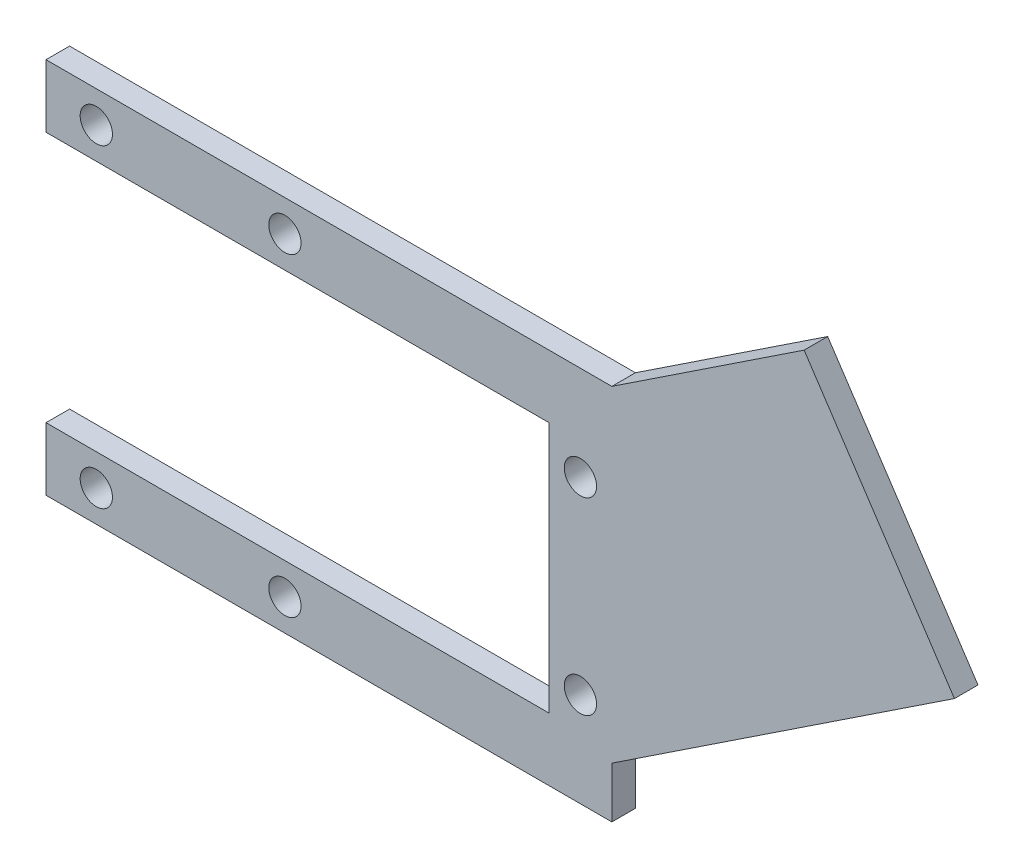
ISO-10303-21;
HEADER;
FILE_DESCRIPTION(('STEP AP214'),'2;1');
FILE_NAME('part.step','',(''),(''),'','','');
FILE_SCHEMA(('AUTOMOTIVE_DESIGN { 1 0 10303 214 1 1 1 1 }'));
ENDSEC;
DATA;
#1=APPLICATION_CONTEXT('core data for automotive mechanical design processes');
#2=APPLICATION_PROTOCOL_DEFINITION('international standard','automotive_design',2000,#1);
#3=PRODUCT_CONTEXT('',#1,'mechanical');
#4=PRODUCT('Part','Part','',(#3));
#5=PRODUCT_RELATED_PRODUCT_CATEGORY('part','',(#4));
#6=PRODUCT_DEFINITION_FORMATION('','',#4);
#7=PRODUCT_DEFINITION_CONTEXT('part definition',#1,'design');
#8=PRODUCT_DEFINITION('design','',#6,#7);
#9=PRODUCT_DEFINITION_SHAPE('','',#8);
#10=(LENGTH_UNIT() NAMED_UNIT(*) SI_UNIT(.MILLI.,.METRE.));
#11=(NAMED_UNIT(*) PLANE_ANGLE_UNIT() SI_UNIT($,.RADIAN.));
#12=(NAMED_UNIT(*) SI_UNIT($,.STERADIAN.) SOLID_ANGLE_UNIT());
#13=UNCERTAINTY_MEASURE_WITH_UNIT(LENGTH_MEASURE(1.E-05),#10,'distance_accuracy_value','');
#14=(GEOMETRIC_REPRESENTATION_CONTEXT(3) GLOBAL_UNCERTAINTY_ASSIGNED_CONTEXT((#13)) GLOBAL_UNIT_ASSIGNED_CONTEXT((#10,
#11,#12)) REPRESENTATION_CONTEXT('',''));
#15=CARTESIAN_POINT('',(0.,0.,0.));
#16=DIRECTION('',(0.,0.,1.));
#17=DIRECTION('',(1.,0.,0.));
#18=AXIS2_PLACEMENT_3D('',#15,#16,#17);
#19=CARTESIAN_POINT('',(0.,0.,4.7625));
#20=DIRECTION('',(0.,0.,1.));
#21=DIRECTION('',(1.,0.,0.));
#22=AXIS2_PLACEMENT_3D('',#19,#20,#21);
#23=PLANE('',#22);
#24=CARTESIAN_POINT('',(107.95,-6.34999999999999,4.7625));
#25=DIRECTION('',(0.,0.,1.));
#26=DIRECTION('',(1.,0.,0.));
#27=AXIS2_PLACEMENT_3D('',#24,#25,#26);
#28=CIRCLE('',#27,3.26389999999999);
#29=CARTESIAN_POINT('',(111.2139,-6.34999999999999,4.7625));
#30=VERTEX_POINT('',#29);
#31=EDGE_CURVE('E280',#30,#30,#28,.T.);
#32=ORIENTED_EDGE('',*,*,#31,.F.);
#33=EDGE_LOOP('',(#32));
#34=FACE_BOUND('',#33,.T.);
#35=CARTESIAN_POINT('',(107.95,-44.45,4.7625));
#36=DIRECTION('',(0.,0.,1.));
#37=DIRECTION('',(1.,0.,0.));
#38=AXIS2_PLACEMENT_3D('',#35,#36,#37);
#39=CIRCLE('',#38,3.2639);
#40=CARTESIAN_POINT('',(111.2139,-44.45,4.7625));
#41=VERTEX_POINT('',#40);
#42=EDGE_CURVE('E289',#41,#41,#39,.T.);
#43=ORIENTED_EDGE('',*,*,#42,.F.);
#44=EDGE_LOOP('',(#43));
#45=FACE_BOUND('',#44,.T.);
#46=CARTESIAN_POINT('',(10.16,-57.15,4.7625));
#47=DIRECTION('',(0.,0.,1.));
#48=DIRECTION('',(1.,0.,0.));
#49=AXIS2_PLACEMENT_3D('',#46,#47,#48);
#50=CIRCLE('',#49,3.26390000000001);
#51=CARTESIAN_POINT('',(13.4239,-57.15,4.7625));
#52=VERTEX_POINT('',#51);
#53=EDGE_CURVE('E300',#52,#52,#50,.T.);
#54=ORIENTED_EDGE('',*,*,#53,.F.);
#55=EDGE_LOOP('',(#54));
#56=FACE_BOUND('',#55,.T.);
#57=CARTESIAN_POINT('',(10.16,6.35,4.7625));
#58=DIRECTION('',(0.,0.,1.));
#59=DIRECTION('',(1.,0.,0.));
#60=AXIS2_PLACEMENT_3D('',#57,#58,#59);
#61=CIRCLE('',#60,3.26390000000001);
#62=CARTESIAN_POINT('',(13.4239,6.35,4.7625));
#63=VERTEX_POINT('',#62);
#64=EDGE_CURVE('E156',#63,#63,#61,.T.);
#65=ORIENTED_EDGE('',*,*,#64,.F.);
#66=EDGE_LOOP('',(#65));
#67=FACE_BOUND('',#66,.T.);
#68=DIRECTION('',(0.,-1.,0.));
#69=VECTOR('',#68,1.);
#70=CARTESIAN_POINT('',(0.,12.7,4.7625));
#71=LINE('',#70,#69);
#72=CARTESIAN_POINT('',(0.,12.7,4.7625));
#73=VERTEX_POINT('',#72);
#74=CARTESIAN_POINT('',(0.,0.,4.7625));
#75=VERTEX_POINT('',#74);
#76=EDGE_CURVE('E173',#73,#75,#71,.T.);
#77=ORIENTED_EDGE('',*,*,#76,.T.);
#78=DIRECTION('',(1.,0.,0.));
#79=VECTOR('',#78,1.);
#80=CARTESIAN_POINT('',(0.,0.,4.7625));
#81=LINE('',#80,#79);
#82=CARTESIAN_POINT('',(101.6,0.,4.7625));
#83=VERTEX_POINT('',#82);
#84=EDGE_CURVE('E106',#75,#83,#81,.T.);
#85=ORIENTED_EDGE('',*,*,#84,.T.);
#86=DIRECTION('',(0.,-1.,0.));
#87=VECTOR('',#86,1.);
#88=CARTESIAN_POINT('',(101.6,0.,4.7625));
#89=LINE('',#88,#87);
#90=CARTESIAN_POINT('',(101.6,-50.8,4.7625));
#91=VERTEX_POINT('',#90);
#92=EDGE_CURVE('E197',#83,#91,#89,.T.);
#93=ORIENTED_EDGE('',*,*,#92,.T.);
#94=DIRECTION('',(-1.,0.,0.));
#95=VECTOR('',#94,1.);
#96=CARTESIAN_POINT('',(101.6,-50.8,4.7625));
#97=LINE('',#96,#95);
#98=CARTESIAN_POINT('',(0.,-50.8,4.7625));
#99=VERTEX_POINT('',#98);
#100=EDGE_CURVE('E216',#91,#99,#97,.T.);
#101=ORIENTED_EDGE('',*,*,#100,.T.);
#102=DIRECTION('',(0.,-1.,0.));
#103=VECTOR('',#102,1.);
#104=CARTESIAN_POINT('',(0.,-50.8,4.7625));
#105=LINE('',#104,#103);
#106=CARTESIAN_POINT('',(0.,-63.5,4.7625));
#107=VERTEX_POINT('',#106);
#108=EDGE_CURVE('E213',#99,#107,#105,.T.);
#109=ORIENTED_EDGE('',*,*,#108,.T.);
#110=DIRECTION('',(1.,0.,0.));
#111=VECTOR('',#110,1.);
#112=CARTESIAN_POINT('',(0.,-63.5,4.7625));
#113=LINE('',#112,#111);
#114=CARTESIAN_POINT('',(114.3,-63.5,4.7625));
#115=VERTEX_POINT('',#114);
#116=EDGE_CURVE('E215',#107,#115,#113,.T.);
#117=ORIENTED_EDGE('',*,*,#116,.T.);
#118=DIRECTION('',(0.,1.,0.));
#119=VECTOR('',#118,1.);
#120=CARTESIAN_POINT('',(114.3,-53.215281421838,4.7625));
#121=LINE('',#120,#119);
#122=CARTESIAN_POINT('',(114.3,-53.215281421838,4.7625));
#123=VERTEX_POINT('',#122);
#124=EDGE_CURVE('E218',#115,#123,#121,.T.);
#125=ORIENTED_EDGE('',*,*,#124,.T.);
#126=DIRECTION('',(0.833382067243564,0.552697322226953,0.));
#127=VECTOR('',#126,1.);
#128=CARTESIAN_POINT('',(183.499345052176,-7.32241401625874,4.7625));
#129=LINE('',#128,#127);
#130=CARTESIAN_POINT('',(183.499345052176,-7.32241401625874,4.7625));
#131=VERTEX_POINT('',#130);
#132=EDGE_CURVE('E134',#123,#131,#129,.T.);
#133=ORIENTED_EDGE('',*,*,#132,.T.);
#134=DIRECTION('',(-0.552697322226953,0.833382067243564,0.));
#135=VECTOR('',#134,1.);
#136=CARTESIAN_POINT('',(153.138236670963,38.4574409766899,4.7625));
#137=LINE('',#136,#135);
#138=CARTESIAN_POINT('',(153.138236670963,38.4574409766899,4.7625));
#139=VERTEX_POINT('',#138);
#140=EDGE_CURVE('E128',#131,#139,#137,.T.);
#141=ORIENTED_EDGE('',*,*,#140,.T.);
#142=DIRECTION('',(-0.833382067243564,-0.552697322226953,0.));
#143=VECTOR('',#142,1.);
#144=CARTESIAN_POINT('',(114.3,12.7,4.7625));
#145=LINE('',#144,#143);
#146=CARTESIAN_POINT('',(114.3,12.7,4.7625));
#147=VERTEX_POINT('',#146);
#148=EDGE_CURVE('E132',#139,#147,#145,.T.);
#149=ORIENTED_EDGE('',*,*,#148,.T.);
#150=DIRECTION('',(-1.,0.,0.));
#151=VECTOR('',#150,1.);
#152=CARTESIAN_POINT('',(114.3,12.7,4.7625));
#153=LINE('',#152,#151);
#154=EDGE_CURVE('E54',#147,#73,#153,.T.);
#155=ORIENTED_EDGE('',*,*,#154,.T.);
#156=EDGE_LOOP('',(#77,#85,#93,#101,#109,#117,#125,#133,#141,#149,#155));
#157=FACE_BOUND('',#156,.T.);
#158=CARTESIAN_POINT('',(48.26,6.35,4.7625));
#159=DIRECTION('',(0.,0.,1.));
#160=DIRECTION('',(1.,0.,0.));
#161=AXIS2_PLACEMENT_3D('',#158,#159,#160);
#162=CIRCLE('',#161,3.26389999999999);
#163=CARTESIAN_POINT('',(51.5239,6.35,4.7625));
#164=VERTEX_POINT('',#163);
#165=EDGE_CURVE('E306',#164,#164,#162,.T.);
#166=ORIENTED_EDGE('',*,*,#165,.F.);
#167=EDGE_LOOP('',(#166));
#168=FACE_BOUND('',#167,.T.);
#169=CARTESIAN_POINT('',(48.26,-57.15,4.7625));
#170=DIRECTION('',(0.,0.,1.));
#171=DIRECTION('',(1.,0.,0.));
#172=AXIS2_PLACEMENT_3D('',#169,#170,#171);
#173=CIRCLE('',#172,3.26389999999999);
#174=CARTESIAN_POINT('',(51.5239,-57.15,4.7625));
#175=VERTEX_POINT('',#174);
#176=EDGE_CURVE('E287',#175,#175,#173,.T.);
#177=ORIENTED_EDGE('',*,*,#176,.F.);
#178=EDGE_LOOP('',(#177));
#179=FACE_BOUND('',#178,.T.);
#180=ADVANCED_FACE('F37',(#34,#45,#56,#67,#157,#168,#179),#23,.T.);
#181=CARTESIAN_POINT('',(0.,0.,0.));
#182=DIRECTION('',(0.,0.,1.));
#183=DIRECTION('',(1.,0.,0.));
#184=AXIS2_PLACEMENT_3D('',#181,#182,#183);
#185=PLANE('',#184);
#186=CARTESIAN_POINT('',(107.95,-6.34999999999999,0.));
#187=DIRECTION('',(0.,0.,1.));
#188=DIRECTION('',(1.,0.,0.));
#189=AXIS2_PLACEMENT_3D('',#186,#187,#188);
#190=CIRCLE('',#189,3.26389999999999);
#191=CARTESIAN_POINT('',(111.2139,-6.34999999999999,0.));
#192=VERTEX_POINT('',#191);
#193=EDGE_CURVE('E283',#192,#192,#190,.F.);
#194=ORIENTED_EDGE('',*,*,#193,.F.);
#195=EDGE_LOOP('',(#194));
#196=FACE_BOUND('',#195,.T.);
#197=CARTESIAN_POINT('',(107.95,-44.45,0.));
#198=DIRECTION('',(0.,0.,1.));
#199=DIRECTION('',(1.,0.,0.));
#200=AXIS2_PLACEMENT_3D('',#197,#198,#199);
#201=CIRCLE('',#200,3.2639);
#202=CARTESIAN_POINT('',(111.2139,-44.45,0.));
#203=VERTEX_POINT('',#202);
#204=EDGE_CURVE('E292',#203,#203,#201,.F.);
#205=ORIENTED_EDGE('',*,*,#204,.F.);
#206=EDGE_LOOP('',(#205));
#207=FACE_BOUND('',#206,.T.);
#208=DIRECTION('',(0.,-1.,0.));
#209=VECTOR('',#208,1.);
#210=CARTESIAN_POINT('',(0.,12.7,0.));
#211=LINE('',#210,#209);
#212=CARTESIAN_POINT('',(0.,12.7,0.));
#213=VERTEX_POINT('',#212);
#214=CARTESIAN_POINT('',(0.,0.,0.));
#215=VERTEX_POINT('',#214);
#216=EDGE_CURVE('E152',#213,#215,#211,.T.);
#217=ORIENTED_EDGE('',*,*,#216,.F.);
#218=DIRECTION('',(-1.,0.,0.));
#219=VECTOR('',#218,1.);
#220=CARTESIAN_POINT('',(114.3,12.7,0.));
#221=LINE('',#220,#219);
#222=CARTESIAN_POINT('',(114.3,12.7,0.));
#223=VERTEX_POINT('',#222);
#224=EDGE_CURVE('E98',#223,#213,#221,.T.);
#225=ORIENTED_EDGE('',*,*,#224,.F.);
#226=DIRECTION('',(-0.833382067243564,-0.552697322226953,0.));
#227=VECTOR('',#226,1.);
#228=CARTESIAN_POINT('',(114.3,12.7,0.));
#229=LINE('',#228,#227);
#230=CARTESIAN_POINT('',(153.138236670963,38.4574409766899,0.));
#231=VERTEX_POINT('',#230);
#232=EDGE_CURVE('E92',#231,#223,#229,.T.);
#233=ORIENTED_EDGE('',*,*,#232,.F.);
#234=DIRECTION('',(-0.552697322226953,0.833382067243564,0.));
#235=VECTOR('',#234,1.);
#236=CARTESIAN_POINT('',(153.138236670963,38.4574409766899,0.));
#237=LINE('',#236,#235);
#238=CARTESIAN_POINT('',(183.499345052176,-7.32241401625874,0.));
#239=VERTEX_POINT('',#238);
#240=EDGE_CURVE('E142',#239,#231,#237,.T.);
#241=ORIENTED_EDGE('',*,*,#240,.F.);
#242=DIRECTION('',(0.833382067243564,0.552697322226953,0.));
#243=VECTOR('',#242,1.);
#244=CARTESIAN_POINT('',(183.499345052176,-7.32241401625874,0.));
#245=LINE('',#244,#243);
#246=CARTESIAN_POINT('',(114.3,-53.215281421838,0.));
#247=VERTEX_POINT('',#246);
#248=EDGE_CURVE('E168',#247,#239,#245,.T.);
#249=ORIENTED_EDGE('',*,*,#248,.F.);
#250=DIRECTION('',(0.,1.,0.));
#251=VECTOR('',#250,1.);
#252=CARTESIAN_POINT('',(114.3,-53.215281421838,0.));
#253=LINE('',#252,#251);
#254=CARTESIAN_POINT('',(114.3,-63.5,0.));
#255=VERTEX_POINT('',#254);
#256=EDGE_CURVE('E166',#255,#247,#253,.T.);
#257=ORIENTED_EDGE('',*,*,#256,.F.);
#258=DIRECTION('',(1.,0.,0.));
#259=VECTOR('',#258,1.);
#260=CARTESIAN_POINT('',(0.,-63.5,0.));
#261=LINE('',#260,#259);
#262=CARTESIAN_POINT('',(0.,-63.5,0.));
#263=VERTEX_POINT('',#262);
#264=EDGE_CURVE('E164',#263,#255,#261,.T.);
#265=ORIENTED_EDGE('',*,*,#264,.F.);
#266=DIRECTION('',(0.,-1.,0.));
#267=VECTOR('',#266,1.);
#268=CARTESIAN_POINT('',(0.,-50.8,0.));
#269=LINE('',#268,#267);
#270=CARTESIAN_POINT('',(0.,-50.8,0.));
#271=VERTEX_POINT('',#270);
#272=EDGE_CURVE('E162',#271,#263,#269,.T.);
#273=ORIENTED_EDGE('',*,*,#272,.F.);
#274=DIRECTION('',(-1.,0.,0.));
#275=VECTOR('',#274,1.);
#276=CARTESIAN_POINT('',(101.6,-50.8,0.));
#277=LINE('',#276,#275);
#278=CARTESIAN_POINT('',(101.6,-50.8,0.));
#279=VERTEX_POINT('',#278);
#280=EDGE_CURVE('E160',#279,#271,#277,.T.);
#281=ORIENTED_EDGE('',*,*,#280,.F.);
#282=DIRECTION('',(0.,-1.,0.));
#283=VECTOR('',#282,1.);
#284=CARTESIAN_POINT('',(101.6,0.,0.));
#285=LINE('',#284,#283);
#286=CARTESIAN_POINT('',(101.6,0.,0.));
#287=VERTEX_POINT('',#286);
#288=EDGE_CURVE('E158',#287,#279,#285,.T.);
#289=ORIENTED_EDGE('',*,*,#288,.F.);
#290=DIRECTION('',(1.,0.,0.));
#291=VECTOR('',#290,1.);
#292=CARTESIAN_POINT('',(0.,0.,0.));
#293=LINE('',#292,#291);
#294=EDGE_CURVE('E155',#215,#287,#293,.T.);
#295=ORIENTED_EDGE('',*,*,#294,.F.);
#296=EDGE_LOOP('',(#217,#225,#233,#241,#249,#257,#265,#273,#281,#289,#295));
#297=FACE_BOUND('',#296,.T.);
#298=CARTESIAN_POINT('',(10.16,6.35,0.));
#299=DIRECTION('',(0.,0.,1.));
#300=DIRECTION('',(1.,0.,0.));
#301=AXIS2_PLACEMENT_3D('',#298,#299,#300);
#302=CIRCLE('',#301,3.26390000000001);
#303=CARTESIAN_POINT('',(13.4239,6.35,0.));
#304=VERTEX_POINT('',#303);
#305=EDGE_CURVE('E309',#304,#304,#302,.T.);
#306=ORIENTED_EDGE('',*,*,#305,.T.);
#307=EDGE_LOOP('',(#306));
#308=FACE_BOUND('',#307,.T.);
#309=CARTESIAN_POINT('',(48.26,6.35,0.));
#310=DIRECTION('',(0.,0.,1.));
#311=DIRECTION('',(1.,0.,0.));
#312=AXIS2_PLACEMENT_3D('',#309,#310,#311);
#313=CIRCLE('',#312,3.26389999999999);
#314=CARTESIAN_POINT('',(51.5239,6.35,0.));
#315=VERTEX_POINT('',#314);
#316=EDGE_CURVE('E303',#315,#315,#313,.T.);
#317=ORIENTED_EDGE('',*,*,#316,.T.);
#318=EDGE_LOOP('',(#317));
#319=FACE_BOUND('',#318,.T.);
#320=CARTESIAN_POINT('',(10.16,-57.15,0.));
#321=DIRECTION('',(0.,0.,1.));
#322=DIRECTION('',(1.,0.,0.));
#323=AXIS2_PLACEMENT_3D('',#320,#321,#322);
#324=CIRCLE('',#323,3.26390000000001);
#325=CARTESIAN_POINT('',(13.4239,-57.15,0.));
#326=VERTEX_POINT('',#325);
#327=EDGE_CURVE('E298',#326,#326,#324,.T.);
#328=ORIENTED_EDGE('',*,*,#327,.T.);
#329=EDGE_LOOP('',(#328));
#330=FACE_BOUND('',#329,.T.);
#331=CARTESIAN_POINT('',(48.26,-57.15,0.));
#332=DIRECTION('',(0.,0.,1.));
#333=DIRECTION('',(1.,0.,0.));
#334=AXIS2_PLACEMENT_3D('',#331,#332,#333);
#335=CIRCLE('',#334,3.26389999999999);
#336=CARTESIAN_POINT('',(51.5239,-57.15,0.));
#337=VERTEX_POINT('',#336);
#338=EDGE_CURVE('E284',#337,#337,#335,.T.);
#339=ORIENTED_EDGE('',*,*,#338,.T.);
#340=EDGE_LOOP('',(#339));
#341=FACE_BOUND('',#340,.T.);
#342=ADVANCED_FACE('F201',(#196,#207,#297,#308,#319,#330,#341),#185,.F.);
#343=CARTESIAN_POINT('',(0.,12.7,4.7625));
#344=DIRECTION('',(1.,0.,0.));
#345=DIRECTION('',(0.,1.,0.));
#346=AXIS2_PLACEMENT_3D('',#343,#344,#345);
#347=PLANE('',#346);
#348=ORIENTED_EDGE('',*,*,#216,.T.);
#349=DIRECTION('',(0.,0.,-1.));
#350=VECTOR('',#349,1.);
#351=CARTESIAN_POINT('',(0.,0.,4.7625));
#352=LINE('',#351,#350);
#353=EDGE_CURVE('E11',#75,#215,#352,.T.);
#354=ORIENTED_EDGE('',*,*,#353,.F.);
#355=ORIENTED_EDGE('',*,*,#76,.F.);
#356=DIRECTION('',(0.,0.,-1.));
#357=VECTOR('',#356,1.);
#358=CARTESIAN_POINT('',(0.,12.7,4.7625));
#359=LINE('',#358,#357);
#360=EDGE_CURVE('E148',#73,#213,#359,.T.);
#361=ORIENTED_EDGE('',*,*,#360,.T.);
#362=EDGE_LOOP('',(#348,#354,#355,#361));
#363=FACE_BOUND('',#362,.T.);
#364=ADVANCED_FACE('F39',(#363),#347,.F.);
#365=CARTESIAN_POINT('',(0.,0.,4.7625));
#366=DIRECTION('',(0.,1.,0.));
#367=DIRECTION('',(0.,0.,1.));
#368=AXIS2_PLACEMENT_3D('',#365,#366,#367);
#369=PLANE('',#368);
#370=ORIENTED_EDGE('',*,*,#294,.T.);
#371=DIRECTION('',(0.,0.,-1.));
#372=VECTOR('',#371,1.);
#373=CARTESIAN_POINT('',(101.6,0.,4.7625));
#374=LINE('',#373,#372);
#375=EDGE_CURVE('E46',#83,#287,#374,.T.);
#376=ORIENTED_EDGE('',*,*,#375,.F.);
#377=ORIENTED_EDGE('',*,*,#84,.F.);
#378=ORIENTED_EDGE('',*,*,#353,.T.);
#379=EDGE_LOOP('',(#370,#376,#377,#378));
#380=FACE_BOUND('',#379,.T.);
#381=ADVANCED_FACE('F438',(#380),#369,.F.);
#382=CARTESIAN_POINT('',(101.6,0.,4.7625));
#383=DIRECTION('',(1.,0.,0.));
#384=DIRECTION('',(0.,0.,-1.));
#385=AXIS2_PLACEMENT_3D('',#382,#383,#384);
#386=PLANE('',#385);
#387=ORIENTED_EDGE('',*,*,#288,.T.);
#388=DIRECTION('',(0.,0.,-1.));
#389=VECTOR('',#388,1.);
#390=CARTESIAN_POINT('',(101.6,-50.8,4.7625));
#391=LINE('',#390,#389);
#392=EDGE_CURVE('E189',#91,#279,#391,.T.);
#393=ORIENTED_EDGE('',*,*,#392,.F.);
#394=ORIENTED_EDGE('',*,*,#92,.F.);
#395=ORIENTED_EDGE('',*,*,#375,.T.);
#396=EDGE_LOOP('',(#387,#393,#394,#395));
#397=FACE_BOUND('',#396,.T.);
#398=ADVANCED_FACE('F195',(#397),#386,.F.);
#399=CARTESIAN_POINT('',(101.6,-50.8,4.7625));
#400=DIRECTION('',(0.,-1.,0.));
#401=DIRECTION('',(0.,0.,-1.));
#402=AXIS2_PLACEMENT_3D('',#399,#400,#401);
#403=PLANE('',#402);
#404=ORIENTED_EDGE('',*,*,#280,.T.);
#405=DIRECTION('',(0.,0.,-1.));
#406=VECTOR('',#405,1.);
#407=CARTESIAN_POINT('',(0.,-50.8,4.7625));
#408=LINE('',#407,#406);
#409=EDGE_CURVE('E186',#99,#271,#408,.T.);
#410=ORIENTED_EDGE('',*,*,#409,.F.);
#411=ORIENTED_EDGE('',*,*,#100,.F.);
#412=ORIENTED_EDGE('',*,*,#392,.T.);
#413=EDGE_LOOP('',(#404,#410,#411,#412));
#414=FACE_BOUND('',#413,.T.);
#415=ADVANCED_FACE('F207',(#414),#403,.F.);
#416=CARTESIAN_POINT('',(0.,-50.8,4.7625));
#417=DIRECTION('',(1.,0.,0.));
#418=DIRECTION('',(0.,0.,-1.));
#419=AXIS2_PLACEMENT_3D('',#416,#417,#418);
#420=PLANE('',#419);
#421=ORIENTED_EDGE('',*,*,#272,.T.);
#422=DIRECTION('',(0.,0.,-1.));
#423=VECTOR('',#422,1.);
#424=CARTESIAN_POINT('',(0.,-63.5,4.7625));
#425=LINE('',#424,#423);
#426=EDGE_CURVE('E183',#107,#263,#425,.T.);
#427=ORIENTED_EDGE('',*,*,#426,.F.);
#428=ORIENTED_EDGE('',*,*,#108,.F.);
#429=ORIENTED_EDGE('',*,*,#409,.T.);
#430=EDGE_LOOP('',(#421,#427,#428,#429));
#431=FACE_BOUND('',#430,.T.);
#432=ADVANCED_FACE('F211',(#431),#420,.F.);
#433=CARTESIAN_POINT('',(0.,-63.5,4.7625));
#434=DIRECTION('',(0.,1.,0.));
#435=DIRECTION('',(0.,0.,1.));
#436=AXIS2_PLACEMENT_3D('',#433,#434,#435);
#437=PLANE('',#436);
#438=ORIENTED_EDGE('',*,*,#264,.T.);
#439=DIRECTION('',(0.,0.,-1.));
#440=VECTOR('',#439,1.);
#441=CARTESIAN_POINT('',(114.3,-63.5,4.7625));
#442=LINE('',#441,#440);
#443=EDGE_CURVE('E180',#115,#255,#442,.T.);
#444=ORIENTED_EDGE('',*,*,#443,.F.);
#445=ORIENTED_EDGE('',*,*,#116,.F.);
#446=ORIENTED_EDGE('',*,*,#426,.T.);
#447=EDGE_LOOP('',(#438,#444,#445,#446));
#448=FACE_BOUND('',#447,.T.);
#449=ADVANCED_FACE('F400',(#448),#437,.F.);
#450=CARTESIAN_POINT('',(114.3,-53.215281421838,4.7625));
#451=DIRECTION('',(-1.,0.,0.));
#452=DIRECTION('',(0.,0.,1.));
#453=AXIS2_PLACEMENT_3D('',#450,#451,#452);
#454=PLANE('',#453);
#455=ORIENTED_EDGE('',*,*,#256,.T.);
#456=DIRECTION('',(0.,0.,-1.));
#457=VECTOR('',#456,1.);
#458=CARTESIAN_POINT('',(114.3,-53.215281421838,4.7625));
#459=LINE('',#458,#457);
#460=EDGE_CURVE('E177',#123,#247,#459,.T.);
#461=ORIENTED_EDGE('',*,*,#460,.F.);
#462=ORIENTED_EDGE('',*,*,#124,.F.);
#463=ORIENTED_EDGE('',*,*,#443,.T.);
#464=EDGE_LOOP('',(#455,#461,#462,#463));
#465=FACE_BOUND('',#464,.T.);
#466=ADVANCED_FACE('F227',(#465),#454,.F.);
#467=CARTESIAN_POINT('',(183.499345052176,-7.32241401625874,4.7625));
#468=DIRECTION('',(-0.552697322226953,0.833382067243564,0.));
#469=DIRECTION('',(-0.833382067243564,-0.552697322226953,0.));
#470=AXIS2_PLACEMENT_3D('',#467,#468,#469);
#471=PLANE('',#470);
#472=ORIENTED_EDGE('',*,*,#248,.T.);
#473=DIRECTION('',(0.,0.,-1.));
#474=VECTOR('',#473,1.);
#475=CARTESIAN_POINT('',(183.499345052176,-7.32241401625874,4.7625));
#476=LINE('',#475,#474);
#477=EDGE_CURVE('E143',#131,#239,#476,.T.);
#478=ORIENTED_EDGE('',*,*,#477,.F.);
#479=ORIENTED_EDGE('',*,*,#132,.F.);
#480=ORIENTED_EDGE('',*,*,#460,.T.);
#481=EDGE_LOOP('',(#472,#478,#479,#480));
#482=FACE_BOUND('',#481,.T.);
#483=ADVANCED_FACE('F231',(#482),#471,.F.);
#484=CARTESIAN_POINT('',(153.138236670963,38.4574409766899,4.7625));
#485=DIRECTION('',(-0.833382067243564,-0.552697322226953,0.));
#486=DIRECTION('',(0.552697322226953,-0.833382067243564,0.));
#487=AXIS2_PLACEMENT_3D('',#484,#485,#486);
#488=PLANE('',#487);
#489=ORIENTED_EDGE('',*,*,#240,.T.);
#490=DIRECTION('',(0.,0.,-1.));
#491=VECTOR('',#490,1.);
#492=CARTESIAN_POINT('',(153.138236670963,38.4574409766899,4.7625));
#493=LINE('',#492,#491);
#494=EDGE_CURVE('E139',#139,#231,#493,.T.);
#495=ORIENTED_EDGE('',*,*,#494,.F.);
#496=ORIENTED_EDGE('',*,*,#140,.F.);
#497=ORIENTED_EDGE('',*,*,#477,.T.);
#498=EDGE_LOOP('',(#489,#495,#496,#497));
#499=FACE_BOUND('',#498,.T.);
#500=ADVANCED_FACE('F140',(#499),#488,.F.);
#501=CARTESIAN_POINT('',(114.3,12.7,4.7625));
#502=DIRECTION('',(0.552697322226953,-0.833382067243564,0.));
#503=DIRECTION('',(0.833382067243564,0.552697322226953,0.));
#504=AXIS2_PLACEMENT_3D('',#501,#502,#503);
#505=PLANE('',#504);
#506=ORIENTED_EDGE('',*,*,#232,.T.);
#507=DIRECTION('',(0.,0.,-1.));
#508=VECTOR('',#507,1.);
#509=CARTESIAN_POINT('',(114.3,12.7,4.7625));
#510=LINE('',#509,#508);
#511=EDGE_CURVE('E144',#147,#223,#510,.T.);
#512=ORIENTED_EDGE('',*,*,#511,.F.);
#513=ORIENTED_EDGE('',*,*,#148,.F.);
#514=ORIENTED_EDGE('',*,*,#494,.T.);
#515=EDGE_LOOP('',(#506,#512,#513,#514));
#516=FACE_BOUND('',#515,.T.);
#517=ADVANCED_FACE('F146',(#516),#505,.F.);
#518=CARTESIAN_POINT('',(114.3,12.7,4.7625));
#519=DIRECTION('',(0.,-1.,0.));
#520=DIRECTION('',(1.,0.,0.));
#521=AXIS2_PLACEMENT_3D('',#518,#519,#520);
#522=PLANE('',#521);
#523=ORIENTED_EDGE('',*,*,#224,.T.);
#524=ORIENTED_EDGE('',*,*,#360,.F.);
#525=ORIENTED_EDGE('',*,*,#154,.F.);
#526=ORIENTED_EDGE('',*,*,#511,.T.);
#527=EDGE_LOOP('',(#523,#524,#525,#526));
#528=FACE_BOUND('',#527,.T.);
#529=ADVANCED_FACE('F235',(#528),#522,.F.);
#530=CARTESIAN_POINT('',(10.16,6.35,4.7625));
#531=DIRECTION('',(0.,0.,-1.));
#532=DIRECTION('',(-1.,0.,0.));
#533=AXIS2_PLACEMENT_3D('',#530,#531,#532);
#534=CYLINDRICAL_SURFACE('',#533,3.26390000000001);
#535=ORIENTED_EDGE('',*,*,#64,.T.);
#536=EDGE_LOOP('',(#535));
#537=FACE_BOUND('',#536,.T.);
#538=ORIENTED_EDGE('',*,*,#305,.F.);
#539=EDGE_LOOP('',(#538));
#540=FACE_BOUND('',#539,.T.);
#541=ADVANCED_FACE('F237',(#537,#540),#534,.F.);
#542=CARTESIAN_POINT('',(48.26,6.35,4.7625));
#543=DIRECTION('',(0.,0.,-1.));
#544=DIRECTION('',(-1.,0.,0.));
#545=AXIS2_PLACEMENT_3D('',#542,#543,#544);
#546=CYLINDRICAL_SURFACE('',#545,3.26389999999999);
#547=ORIENTED_EDGE('',*,*,#165,.T.);
#548=EDGE_LOOP('',(#547));
#549=FACE_BOUND('',#548,.T.);
#550=ORIENTED_EDGE('',*,*,#316,.F.);
#551=EDGE_LOOP('',(#550));
#552=FACE_BOUND('',#551,.T.);
#553=ADVANCED_FACE('F243',(#549,#552),#546,.F.);
#554=CARTESIAN_POINT('',(10.16,-57.15,4.7625));
#555=DIRECTION('',(0.,0.,-1.));
#556=DIRECTION('',(-1.,0.,0.));
#557=AXIS2_PLACEMENT_3D('',#554,#555,#556);
#558=CYLINDRICAL_SURFACE('',#557,3.26390000000001);
#559=ORIENTED_EDGE('',*,*,#53,.T.);
#560=EDGE_LOOP('',(#559));
#561=FACE_BOUND('',#560,.T.);
#562=ORIENTED_EDGE('',*,*,#327,.F.);
#563=EDGE_LOOP('',(#562));
#564=FACE_BOUND('',#563,.T.);
#565=ADVANCED_FACE('F260',(#561,#564),#558,.F.);
#566=CARTESIAN_POINT('',(48.26,-57.15,4.7625));
#567=DIRECTION('',(0.,0.,-1.));
#568=DIRECTION('',(-1.,0.,0.));
#569=AXIS2_PLACEMENT_3D('',#566,#567,#568);
#570=CYLINDRICAL_SURFACE('',#569,3.26389999999999);
#571=ORIENTED_EDGE('',*,*,#176,.T.);
#572=EDGE_LOOP('',(#571));
#573=FACE_BOUND('',#572,.T.);
#574=ORIENTED_EDGE('',*,*,#338,.F.);
#575=EDGE_LOOP('',(#574));
#576=FACE_BOUND('',#575,.T.);
#577=ADVANCED_FACE('F264',(#573,#576),#570,.F.);
#578=CARTESIAN_POINT('',(107.95,-44.45,-0.00100000000000013));
#579=DIRECTION('',(0.,0.,1.));
#580=DIRECTION('',(1.,0.,0.));
#581=AXIS2_PLACEMENT_3D('',#578,#579,#580);
#582=CYLINDRICAL_SURFACE('',#581,3.2639);
#583=ORIENTED_EDGE('',*,*,#42,.T.);
#584=EDGE_LOOP('',(#583));
#585=FACE_BOUND('',#584,.T.);
#586=ORIENTED_EDGE('',*,*,#204,.T.);
#587=EDGE_LOOP('',(#586));
#588=FACE_BOUND('',#587,.T.);
#589=ADVANCED_FACE('F268',(#585,#588),#582,.F.);
#590=CARTESIAN_POINT('',(107.95,-6.34999999999999,-0.00100000000000013));
#591=DIRECTION('',(0.,0.,1.));
#592=DIRECTION('',(1.,0.,0.));
#593=AXIS2_PLACEMENT_3D('',#590,#591,#592);
#594=CYLINDRICAL_SURFACE('',#593,3.26389999999999);
#595=ORIENTED_EDGE('',*,*,#31,.T.);
#596=EDGE_LOOP('',(#595));
#597=FACE_BOUND('',#596,.T.);
#598=ORIENTED_EDGE('',*,*,#193,.T.);
#599=EDGE_LOOP('',(#598));
#600=FACE_BOUND('',#599,.T.);
#601=ADVANCED_FACE('F272',(#597,#600),#594,.F.);
#602=CLOSED_SHELL('',(#180,#342,#364,#381,#398,#415,#432,#449,#466,#483,#500,#517,#529,#541,
#553,#565,#577,#589,#601));
#603=MANIFOLD_SOLID_BREP('B2',#602);
#604=ADVANCED_BREP_SHAPE_REPRESENTATION('',(#18,#603),#14);
#605=SHAPE_DEFINITION_REPRESENTATION(#9,#604);
ENDSEC;
END-ISO-10303-21;
